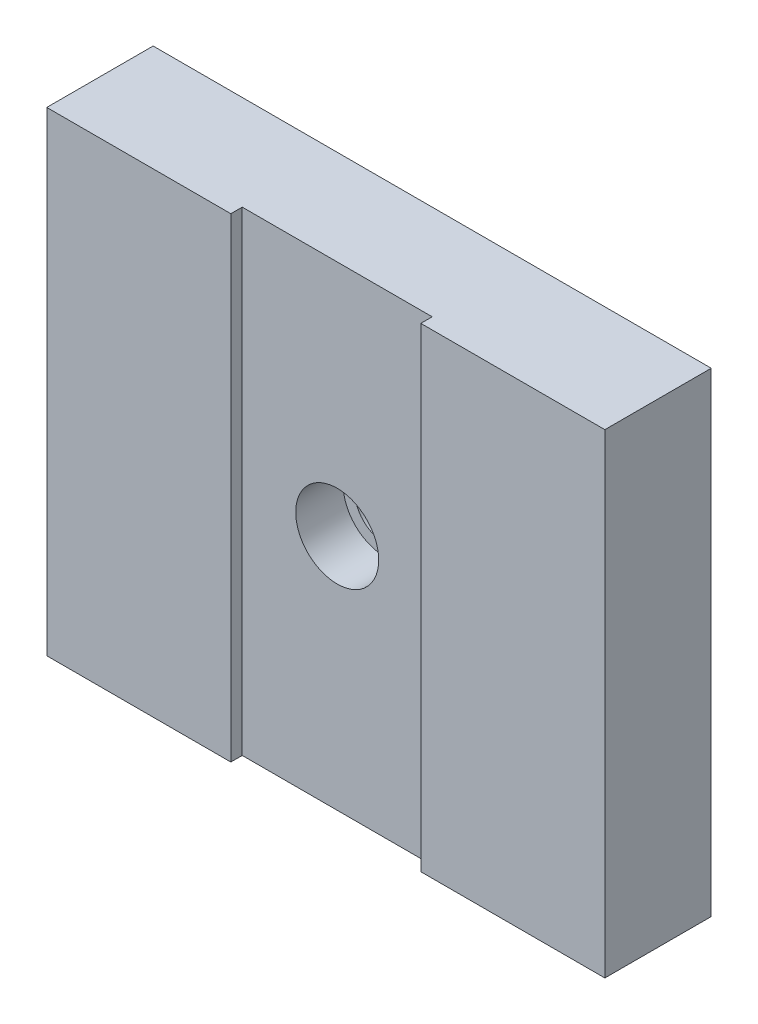
ISO-10303-21;
HEADER;
FILE_DESCRIPTION(('STEP AP214'),'2;1');
FILE_NAME('part.step','',(''),(''),'','','');
FILE_SCHEMA(('AUTOMOTIVE_DESIGN { 1 0 10303 214 1 1 1 1 }'));
ENDSEC;
DATA;
#1=APPLICATION_CONTEXT('core data for automotive mechanical design processes');
#2=APPLICATION_PROTOCOL_DEFINITION('international standard','automotive_design',2000,#1);
#3=PRODUCT_CONTEXT('',#1,'mechanical');
#4=PRODUCT('Part','Part','',(#3));
#5=PRODUCT_RELATED_PRODUCT_CATEGORY('part','',(#4));
#6=PRODUCT_DEFINITION_FORMATION('','',#4);
#7=PRODUCT_DEFINITION_CONTEXT('part definition',#1,'design');
#8=PRODUCT_DEFINITION('design','',#6,#7);
#9=PRODUCT_DEFINITION_SHAPE('','',#8);
#10=(LENGTH_UNIT() NAMED_UNIT(*) SI_UNIT(.MILLI.,.METRE.));
#11=(NAMED_UNIT(*) PLANE_ANGLE_UNIT() SI_UNIT($,.RADIAN.));
#12=(NAMED_UNIT(*) SI_UNIT($,.STERADIAN.) SOLID_ANGLE_UNIT());
#13=UNCERTAINTY_MEASURE_WITH_UNIT(LENGTH_MEASURE(1.E-05),#10,'distance_accuracy_value','');
#14=(GEOMETRIC_REPRESENTATION_CONTEXT(3) GLOBAL_UNCERTAINTY_ASSIGNED_CONTEXT((#13)) GLOBAL_UNIT_ASSIGNED_CONTEXT((#10,
#11,#12)) REPRESENTATION_CONTEXT('',''));
#15=CARTESIAN_POINT('',(0.,0.,0.));
#16=DIRECTION('',(0.,0.,1.));
#17=DIRECTION('',(1.,0.,0.));
#18=AXIS2_PLACEMENT_3D('',#15,#16,#17);
#19=CARTESIAN_POINT('',(37.3126,31.75,14.224));
#20=DIRECTION('',(0.,0.,1.));
#21=DIRECTION('',(1.,0.,0.));
#22=AXIS2_PLACEMENT_3D('',#19,#20,#21);
#23=CYLINDRICAL_SURFACE('',#22,4.0132);
#24=CARTESIAN_POINT('',(37.3126,31.75,6.35));
#25=DIRECTION('',(0.,0.,1.));
#26=DIRECTION('',(1.,0.,0.));
#27=AXIS2_PLACEMENT_3D('',#24,#25,#26);
#28=CIRCLE('',#27,4.0132);
#29=CARTESIAN_POINT('',(41.3258,31.75,6.35));
#30=VERTEX_POINT('',#29);
#31=EDGE_CURVE('E148',#30,#30,#28,.T.);
#32=ORIENTED_EDGE('',*,*,#31,.T.);
#33=EDGE_LOOP('',(#32));
#34=FACE_BOUND('',#33,.T.);
#35=CARTESIAN_POINT('',(37.3126,31.75,1.397));
#36=DIRECTION('',(0.,0.,-1.));
#37=DIRECTION('',(-1.,0.,0.));
#38=AXIS2_PLACEMENT_3D('',#35,#36,#37);
#39=CIRCLE('',#38,4.0132);
#40=CARTESIAN_POINT('',(33.2994,31.75,1.397));
#41=VERTEX_POINT('',#40);
#42=EDGE_CURVE('E36',#41,#41,#39,.F.);
#43=ORIENTED_EDGE('',*,*,#42,.F.);
#44=EDGE_LOOP('',(#43));
#45=FACE_BOUND('',#44,.T.);
#46=ADVANCED_FACE('F32',(#34,#45),#23,.F.);
#47=CARTESIAN_POINT('',(0.,63.5,14.224));
#48=DIRECTION('',(0.,0.,-1.));
#49=DIRECTION('',(-1.,0.,0.));
#50=AXIS2_PLACEMENT_3D('',#47,#48,#49);
#51=PLANE('',#50);
#52=DIRECTION('',(-1.,0.,0.));
#53=VECTOR('',#52,1.);
#54=CARTESIAN_POINT('',(0.,63.5,14.224));
#55=LINE('',#54,#53);
#56=CARTESIAN_POINT('',(74.6252,63.5,14.224));
#57=VERTEX_POINT('',#56);
#58=CARTESIAN_POINT('',(50.0126,63.5,14.224));
#59=VERTEX_POINT('',#58);
#60=EDGE_CURVE('E158',#57,#59,#55,.T.);
#61=ORIENTED_EDGE('',*,*,#60,.T.);
#62=DIRECTION('',(0.,1.,0.));
#63=VECTOR('',#62,1.);
#64=CARTESIAN_POINT('',(50.0126,0.,14.224));
#65=LINE('',#64,#63);
#66=CARTESIAN_POINT('',(50.0126,0.,14.224));
#67=VERTEX_POINT('',#66);
#68=EDGE_CURVE('E114',#67,#59,#65,.T.);
#69=ORIENTED_EDGE('',*,*,#68,.F.);
#70=DIRECTION('',(1.,0.,0.));
#71=VECTOR('',#70,1.);
#72=CARTESIAN_POINT('',(0.,0.,14.224));
#73=LINE('',#72,#71);
#74=CARTESIAN_POINT('',(74.6252,0.,14.224));
#75=VERTEX_POINT('',#74);
#76=EDGE_CURVE('E154',#67,#75,#73,.T.);
#77=ORIENTED_EDGE('',*,*,#76,.T.);
#78=DIRECTION('',(0.,1.,0.));
#79=VECTOR('',#78,1.);
#80=CARTESIAN_POINT('',(74.6252,0.,14.224));
#81=LINE('',#80,#79);
#82=EDGE_CURVE('E156',#75,#57,#81,.T.);
#83=ORIENTED_EDGE('',*,*,#82,.T.);
#84=EDGE_LOOP('',(#61,#69,#77,#83));
#85=FACE_BOUND('',#84,.T.);
#86=ADVANCED_FACE('F177',(#85),#51,.F.);
#87=CARTESIAN_POINT('',(37.3126,31.75,14.224));
#88=DIRECTION('',(0.,0.,1.));
#89=DIRECTION('',(1.,0.,0.));
#90=AXIS2_PLACEMENT_3D('',#87,#88,#89);
#91=CYLINDRICAL_SURFACE('',#90,5.5499);
#92=CARTESIAN_POINT('',(37.3126,31.75,6.35));
#93=DIRECTION('',(0.,0.,1.));
#94=DIRECTION('',(1.,0.,0.));
#95=AXIS2_PLACEMENT_3D('',#92,#93,#94);
#96=CIRCLE('',#95,5.5499);
#97=CARTESIAN_POINT('',(42.8625,31.75,6.35));
#98=VERTEX_POINT('',#97);
#99=EDGE_CURVE('E145',#98,#98,#96,.T.);
#100=ORIENTED_EDGE('',*,*,#99,.F.);
#101=EDGE_LOOP('',(#100));
#102=FACE_BOUND('',#101,.T.);
#103=CARTESIAN_POINT('',(37.3126,31.75,12.7));
#104=DIRECTION('',(0.,0.,1.));
#105=DIRECTION('',(1.,0.,0.));
#106=AXIS2_PLACEMENT_3D('',#103,#104,#105);
#107=CIRCLE('',#106,5.5499);
#108=CARTESIAN_POINT('',(42.8625,31.75,12.7));
#109=VERTEX_POINT('',#108);
#110=EDGE_CURVE('E141',#109,#109,#107,.F.);
#111=ORIENTED_EDGE('',*,*,#110,.F.);
#112=EDGE_LOOP('',(#111));
#113=FACE_BOUND('',#112,.T.);
#114=ADVANCED_FACE('F175',(#102,#113),#91,.F.);
#115=CARTESIAN_POINT('',(0.,0.,14.224));
#116=DIRECTION('',(1.,0.,0.));
#117=DIRECTION('',(0.,0.,-1.));
#118=AXIS2_PLACEMENT_3D('',#115,#116,#117);
#119=PLANE('',#118);
#120=DIRECTION('',(0.,-1.,0.));
#121=VECTOR('',#120,1.);
#122=CARTESIAN_POINT('',(0.,0.,0.));
#123=LINE('',#122,#121);
#124=CARTESIAN_POINT('',(0.,63.5,0.));
#125=VERTEX_POINT('',#124);
#126=CARTESIAN_POINT('',(0.,0.,0.));
#127=VERTEX_POINT('',#126);
#128=EDGE_CURVE('E151',#125,#127,#123,.T.);
#129=ORIENTED_EDGE('',*,*,#128,.T.);
#130=DIRECTION('',(0.,0.,-1.));
#131=VECTOR('',#130,1.);
#132=CARTESIAN_POINT('',(0.,0.,14.224));
#133=LINE('',#132,#131);
#134=CARTESIAN_POINT('',(0.,0.,14.224));
#135=VERTEX_POINT('',#134);
#136=EDGE_CURVE('E11',#135,#127,#133,.T.);
#137=ORIENTED_EDGE('',*,*,#136,.F.);
#138=DIRECTION('',(0.,-1.,0.));
#139=VECTOR('',#138,1.);
#140=CARTESIAN_POINT('',(0.,0.,14.224));
#141=LINE('',#140,#139);
#142=CARTESIAN_POINT('',(0.,63.5,14.224));
#143=VERTEX_POINT('',#142);
#144=EDGE_CURVE('E152',#143,#135,#141,.T.);
#145=ORIENTED_EDGE('',*,*,#144,.F.);
#146=DIRECTION('',(0.,0.,-1.));
#147=VECTOR('',#146,1.);
#148=CARTESIAN_POINT('',(0.,63.5,14.224));
#149=LINE('',#148,#147);
#150=EDGE_CURVE('E160',#143,#125,#149,.T.);
#151=ORIENTED_EDGE('',*,*,#150,.T.);
#152=EDGE_LOOP('',(#129,#137,#145,#151));
#153=FACE_BOUND('',#152,.T.);
#154=ADVANCED_FACE('F34',(#153),#119,.F.);
#155=CARTESIAN_POINT('',(0.,0.,14.224));
#156=DIRECTION('',(0.,1.,0.));
#157=DIRECTION('',(0.,0.,1.));
#158=AXIS2_PLACEMENT_3D('',#155,#156,#157);
#159=PLANE('',#158);
#160=ORIENTED_EDGE('',*,*,#76,.F.);
#161=DIRECTION('',(0.,0.,1.));
#162=VECTOR('',#161,1.);
#163=CARTESIAN_POINT('',(50.0126,0.,12.7));
#164=LINE('',#163,#162);
#165=CARTESIAN_POINT('',(50.0126,0.,12.7));
#166=VERTEX_POINT('',#165);
#167=EDGE_CURVE('E139',#166,#67,#164,.T.);
#168=ORIENTED_EDGE('',*,*,#167,.F.);
#169=DIRECTION('',(1.,0.,0.));
#170=VECTOR('',#169,1.);
#171=CARTESIAN_POINT('',(50.0126,0.,12.7));
#172=LINE('',#171,#170);
#173=CARTESIAN_POINT('',(24.6126,0.,12.7));
#174=VERTEX_POINT('',#173);
#175=EDGE_CURVE('E118',#174,#166,#172,.T.);
#176=ORIENTED_EDGE('',*,*,#175,.F.);
#177=DIRECTION('',(0.,0.,1.));
#178=VECTOR('',#177,1.);
#179=CARTESIAN_POINT('',(24.6126,0.,12.7));
#180=LINE('',#179,#178);
#181=CARTESIAN_POINT('',(24.6126,0.,14.224));
#182=VERTEX_POINT('',#181);
#183=EDGE_CURVE('E142',#174,#182,#180,.T.);
#184=ORIENTED_EDGE('',*,*,#183,.T.);
#185=EDGE_CURVE('E86',#135,#182,#73,.T.);
#186=ORIENTED_EDGE('',*,*,#185,.F.);
#187=ORIENTED_EDGE('',*,*,#136,.T.);
#188=DIRECTION('',(1.,0.,0.));
#189=VECTOR('',#188,1.);
#190=CARTESIAN_POINT('',(0.,0.,0.));
#191=LINE('',#190,#189);
#192=CARTESIAN_POINT('',(74.6252,0.,0.));
#193=VERTEX_POINT('',#192);
#194=EDGE_CURVE('E163',#127,#193,#191,.T.);
#195=ORIENTED_EDGE('',*,*,#194,.T.);
#196=DIRECTION('',(0.,0.,-1.));
#197=VECTOR('',#196,1.);
#198=CARTESIAN_POINT('',(74.6252,0.,14.224));
#199=LINE('',#198,#197);
#200=EDGE_CURVE('E41',#75,#193,#199,.T.);
#201=ORIENTED_EDGE('',*,*,#200,.F.);
#202=EDGE_LOOP('',(#160,#168,#176,#184,#186,#187,#195,#201));
#203=FACE_BOUND('',#202,.T.);
#204=ADVANCED_FACE('F184',(#203),#159,.F.);
#205=CARTESIAN_POINT('',(74.6252,0.,14.224));
#206=DIRECTION('',(-1.,0.,0.));
#207=DIRECTION('',(0.,0.,1.));
#208=AXIS2_PLACEMENT_3D('',#205,#206,#207);
#209=PLANE('',#208);
#210=DIRECTION('',(0.,1.,0.));
#211=VECTOR('',#210,1.);
#212=CARTESIAN_POINT('',(74.6252,0.,0.));
#213=LINE('',#212,#211);
#214=CARTESIAN_POINT('',(74.6252,63.5,0.));
#215=VERTEX_POINT('',#214);
#216=EDGE_CURVE('E165',#193,#215,#213,.T.);
#217=ORIENTED_EDGE('',*,*,#216,.T.);
#218=DIRECTION('',(0.,0.,-1.));
#219=VECTOR('',#218,1.);
#220=CARTESIAN_POINT('',(74.6252,63.5,14.224));
#221=LINE('',#220,#219);
#222=EDGE_CURVE('E169',#57,#215,#221,.T.);
#223=ORIENTED_EDGE('',*,*,#222,.F.);
#224=ORIENTED_EDGE('',*,*,#82,.F.);
#225=ORIENTED_EDGE('',*,*,#200,.T.);
#226=EDGE_LOOP('',(#217,#223,#224,#225));
#227=FACE_BOUND('',#226,.T.);
#228=ADVANCED_FACE('F207',(#227),#209,.F.);
#229=CARTESIAN_POINT('',(0.,63.5,14.224));
#230=DIRECTION('',(0.,-1.,0.));
#231=DIRECTION('',(0.,0.,-1.));
#232=AXIS2_PLACEMENT_3D('',#229,#230,#231);
#233=PLANE('',#232);
#234=DIRECTION('',(-1.,0.,0.));
#235=VECTOR('',#234,1.);
#236=CARTESIAN_POINT('',(50.0126,63.5,12.7));
#237=LINE('',#236,#235);
#238=CARTESIAN_POINT('',(50.0126,63.5,12.7));
#239=VERTEX_POINT('',#238);
#240=CARTESIAN_POINT('',(24.6126,63.5,12.7));
#241=VERTEX_POINT('',#240);
#242=EDGE_CURVE('E125',#239,#241,#237,.T.);
#243=ORIENTED_EDGE('',*,*,#242,.F.);
#244=DIRECTION('',(0.,0.,1.));
#245=VECTOR('',#244,1.);
#246=CARTESIAN_POINT('',(50.0126,63.5,12.7));
#247=LINE('',#246,#245);
#248=EDGE_CURVE('E108',#239,#59,#247,.T.);
#249=ORIENTED_EDGE('',*,*,#248,.T.);
#250=ORIENTED_EDGE('',*,*,#60,.F.);
#251=ORIENTED_EDGE('',*,*,#222,.T.);
#252=DIRECTION('',(-1.,0.,0.));
#253=VECTOR('',#252,1.);
#254=CARTESIAN_POINT('',(0.,63.5,0.));
#255=LINE('',#254,#253);
#256=EDGE_CURVE('E79',#215,#125,#255,.T.);
#257=ORIENTED_EDGE('',*,*,#256,.T.);
#258=ORIENTED_EDGE('',*,*,#150,.F.);
#259=CARTESIAN_POINT('',(24.6126,63.5,14.224));
#260=VERTEX_POINT('',#259);
#261=EDGE_CURVE('E57',#260,#143,#55,.T.);
#262=ORIENTED_EDGE('',*,*,#261,.F.);
#263=DIRECTION('',(0.,0.,1.));
#264=VECTOR('',#263,1.);
#265=CARTESIAN_POINT('',(24.6126,63.5,12.7));
#266=LINE('',#265,#264);
#267=EDGE_CURVE('E49',#241,#260,#266,.T.);
#268=ORIENTED_EDGE('',*,*,#267,.F.);
#269=EDGE_LOOP('',(#243,#249,#250,#251,#257,#258,#262,#268));
#270=FACE_BOUND('',#269,.T.);
#271=ADVANCED_FACE('F130',(#270),#233,.F.);
#272=ORIENTED_EDGE('',*,*,#185,.T.);
#273=DIRECTION('',(0.,-1.,0.));
#274=VECTOR('',#273,1.);
#275=CARTESIAN_POINT('',(24.6126,0.,14.224));
#276=LINE('',#275,#274);
#277=EDGE_CURVE('E128',#260,#182,#276,.T.);
#278=ORIENTED_EDGE('',*,*,#277,.F.);
#279=ORIENTED_EDGE('',*,*,#261,.T.);
#280=ORIENTED_EDGE('',*,*,#144,.T.);
#281=EDGE_LOOP('',(#272,#278,#279,#280));
#282=FACE_BOUND('',#281,.T.);
#283=ADVANCED_FACE('F188',(#282),#51,.F.);
#284=CARTESIAN_POINT('',(0.,63.5,0.));
#285=DIRECTION('',(0.,0.,-1.));
#286=DIRECTION('',(-1.,0.,0.));
#287=AXIS2_PLACEMENT_3D('',#284,#285,#286);
#288=PLANE('',#287);
#289=CARTESIAN_POINT('',(37.3126,31.75,0.));
#290=DIRECTION('',(0.,0.,-1.));
#291=DIRECTION('',(-1.,0.,0.));
#292=AXIS2_PLACEMENT_3D('',#289,#290,#291);
#293=CIRCLE('',#292,11.1125);
#294=CARTESIAN_POINT('',(26.2001,31.75,0.));
#295=VERTEX_POINT('',#294);
#296=EDGE_CURVE('E246',#295,#295,#293,.T.);
#297=ORIENTED_EDGE('',*,*,#296,.F.);
#298=EDGE_LOOP('',(#297));
#299=FACE_BOUND('',#298,.T.);
#300=ORIENTED_EDGE('',*,*,#128,.F.);
#301=ORIENTED_EDGE('',*,*,#256,.F.);
#302=ORIENTED_EDGE('',*,*,#216,.F.);
#303=ORIENTED_EDGE('',*,*,#194,.F.);
#304=EDGE_LOOP('',(#300,#301,#302,#303));
#305=FACE_BOUND('',#304,.T.);
#306=ADVANCED_FACE('F201',(#299,#305),#288,.T.);
#307=CARTESIAN_POINT('',(41.3258,31.75,6.35));
#308=DIRECTION('',(0.,0.,-1.));
#309=DIRECTION('',(-1.,0.,0.));
#310=AXIS2_PLACEMENT_3D('',#307,#308,#309);
#311=PLANE('',#310);
#312=ORIENTED_EDGE('',*,*,#31,.F.);
#313=EDGE_LOOP('',(#312));
#314=FACE_BOUND('',#313,.T.);
#315=ORIENTED_EDGE('',*,*,#99,.T.);
#316=EDGE_LOOP('',(#315));
#317=FACE_BOUND('',#316,.T.);
#318=ADVANCED_FACE('F198',(#314,#317),#311,.F.);
#319=CARTESIAN_POINT('',(50.0126,63.5,12.7));
#320=DIRECTION('',(0.,0.,1.));
#321=DIRECTION('',(1.,0.,0.));
#322=AXIS2_PLACEMENT_3D('',#319,#320,#321);
#323=PLANE('',#322);
#324=DIRECTION('',(0.,1.,0.));
#325=VECTOR('',#324,1.);
#326=CARTESIAN_POINT('',(50.0126,0.,12.7));
#327=LINE('',#326,#325);
#328=EDGE_CURVE('E111',#166,#239,#327,.T.);
#329=ORIENTED_EDGE('',*,*,#328,.T.);
#330=ORIENTED_EDGE('',*,*,#242,.T.);
#331=DIRECTION('',(0.,-1.,0.));
#332=VECTOR('',#331,1.);
#333=CARTESIAN_POINT('',(24.6126,0.,12.7));
#334=LINE('',#333,#332);
#335=EDGE_CURVE('E131',#241,#174,#334,.T.);
#336=ORIENTED_EDGE('',*,*,#335,.T.);
#337=ORIENTED_EDGE('',*,*,#175,.T.);
#338=EDGE_LOOP('',(#329,#330,#336,#337));
#339=FACE_BOUND('',#338,.T.);
#340=ORIENTED_EDGE('',*,*,#110,.T.);
#341=EDGE_LOOP('',(#340));
#342=FACE_BOUND('',#341,.T.);
#343=ADVANCED_FACE('F122',(#339,#342),#323,.T.);
#344=CARTESIAN_POINT('',(50.0126,0.,12.7));
#345=DIRECTION('',(1.,0.,0.));
#346=DIRECTION('',(0.,1.,0.));
#347=AXIS2_PLACEMENT_3D('',#344,#345,#346);
#348=PLANE('',#347);
#349=ORIENTED_EDGE('',*,*,#68,.T.);
#350=ORIENTED_EDGE('',*,*,#248,.F.);
#351=ORIENTED_EDGE('',*,*,#328,.F.);
#352=ORIENTED_EDGE('',*,*,#167,.T.);
#353=EDGE_LOOP('',(#349,#350,#351,#352));
#354=FACE_BOUND('',#353,.T.);
#355=ADVANCED_FACE('F110',(#354),#348,.F.);
#356=CARTESIAN_POINT('',(24.6126,0.,12.7));
#357=DIRECTION('',(-1.,0.,0.));
#358=DIRECTION('',(0.,0.,1.));
#359=AXIS2_PLACEMENT_3D('',#356,#357,#358);
#360=PLANE('',#359);
#361=ORIENTED_EDGE('',*,*,#277,.T.);
#362=ORIENTED_EDGE('',*,*,#183,.F.);
#363=ORIENTED_EDGE('',*,*,#335,.F.);
#364=ORIENTED_EDGE('',*,*,#267,.T.);
#365=EDGE_LOOP('',(#361,#362,#363,#364));
#366=FACE_BOUND('',#365,.T.);
#367=ADVANCED_FACE('F222',(#366),#360,.F.);
#368=CARTESIAN_POINT('',(37.3126,31.75,1.397));
#369=DIRECTION('',(0.,0.,-1.));
#370=DIRECTION('',(-1.,0.,0.));
#371=AXIS2_PLACEMENT_3D('',#368,#369,#370);
#372=PLANE('',#371);
#373=CARTESIAN_POINT('',(37.3126,31.75,1.397));
#374=DIRECTION('',(0.,0.,-1.));
#375=DIRECTION('',(-1.,0.,0.));
#376=AXIS2_PLACEMENT_3D('',#373,#374,#375);
#377=CIRCLE('',#376,11.1125);
#378=CARTESIAN_POINT('',(26.2001,31.75,1.397));
#379=VERTEX_POINT('',#378);
#380=EDGE_CURVE('E243',#379,#379,#377,.T.);
#381=ORIENTED_EDGE('',*,*,#380,.T.);
#382=EDGE_LOOP('',(#381));
#383=FACE_BOUND('',#382,.T.);
#384=ORIENTED_EDGE('',*,*,#42,.T.);
#385=EDGE_LOOP('',(#384));
#386=FACE_BOUND('',#385,.T.);
#387=ADVANCED_FACE('F224',(#383,#386),#372,.T.);
#388=CARTESIAN_POINT('',(37.3126,31.75,1.397));
#389=DIRECTION('',(0.,0.,-1.));
#390=DIRECTION('',(-1.,0.,0.));
#391=AXIS2_PLACEMENT_3D('',#388,#389,#390);
#392=CYLINDRICAL_SURFACE('',#391,11.1125);
#393=ORIENTED_EDGE('',*,*,#380,.F.);
#394=EDGE_LOOP('',(#393));
#395=FACE_BOUND('',#394,.T.);
#396=ORIENTED_EDGE('',*,*,#296,.T.);
#397=EDGE_LOOP('',(#396));
#398=FACE_BOUND('',#397,.T.);
#399=ADVANCED_FACE('F230',(#395,#398),#392,.F.);
#400=CLOSED_SHELL('',(#46,#86,#114,#154,#204,#228,#271,#283,#306,#318,#343,#355,#367,#387,#399));
#401=MANIFOLD_SOLID_BREP('B2',#400);
#402=ADVANCED_BREP_SHAPE_REPRESENTATION('',(#18,#401),#14);
#403=SHAPE_DEFINITION_REPRESENTATION(#9,#402);
ENDSEC;
END-ISO-10303-21;
